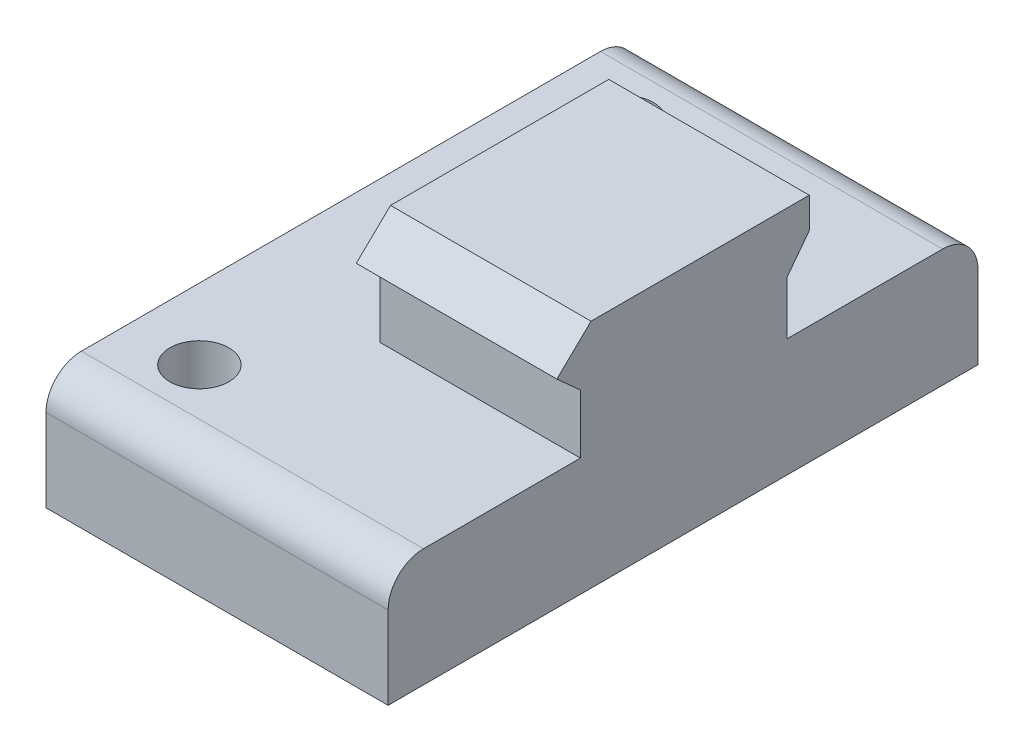
ISO-10303-21;
HEADER;
FILE_DESCRIPTION(('STEP AP214'),'2;1');
FILE_NAME('part.step','',(''),(''),'','','');
FILE_SCHEMA(('AUTOMOTIVE_DESIGN { 1 0 10303 214 1 1 1 1 }'));
ENDSEC;
DATA;
#1=APPLICATION_CONTEXT('core data for automotive mechanical design processes');
#2=APPLICATION_PROTOCOL_DEFINITION('international standard','automotive_design',2000,#1);
#3=PRODUCT_CONTEXT('',#1,'mechanical');
#4=PRODUCT('Part','Part','',(#3));
#5=PRODUCT_RELATED_PRODUCT_CATEGORY('part','',(#4));
#6=PRODUCT_DEFINITION_FORMATION('','',#4);
#7=PRODUCT_DEFINITION_CONTEXT('part definition',#1,'design');
#8=PRODUCT_DEFINITION('design','',#6,#7);
#9=PRODUCT_DEFINITION_SHAPE('','',#8);
#10=(LENGTH_UNIT() NAMED_UNIT(*) SI_UNIT(.MILLI.,.METRE.));
#11=(NAMED_UNIT(*) PLANE_ANGLE_UNIT() SI_UNIT($,.RADIAN.));
#12=(NAMED_UNIT(*) SI_UNIT($,.STERADIAN.) SOLID_ANGLE_UNIT());
#13=UNCERTAINTY_MEASURE_WITH_UNIT(LENGTH_MEASURE(1.E-05),#10,'distance_accuracy_value','');
#14=(GEOMETRIC_REPRESENTATION_CONTEXT(3) GLOBAL_UNCERTAINTY_ASSIGNED_CONTEXT((#13)) GLOBAL_UNIT_ASSIGNED_CONTEXT((#10,
#11,#12)) REPRESENTATION_CONTEXT('',''));
#15=CARTESIAN_POINT('',(0.,0.,0.));
#16=DIRECTION('',(0.,0.,1.));
#17=DIRECTION('',(1.,0.,0.));
#18=AXIS2_PLACEMENT_3D('',#15,#16,#17);
#19=CARTESIAN_POINT('',(-17.,0.,8.7));
#20=DIRECTION('',(0.,0.,1.));
#21=DIRECTION('',(0.,-1.,0.));
#22=AXIS2_PLACEMENT_3D('',#19,#20,#21);
#23=PLANE('',#22);
#24=DIRECTION('',(0.,-1.,0.));
#25=VECTOR('',#24,1.);
#26=CARTESIAN_POINT('',(0.,0.,8.7));
#27=LINE('',#26,#25);
#28=CARTESIAN_POINT('',(0.,-4.6,8.7));
#29=VERTEX_POINT('',#28);
#30=CARTESIAN_POINT('',(0.,-9.6,8.7));
#31=VERTEX_POINT('',#30);
#32=EDGE_CURVE('E169',#29,#31,#27,.T.);
#33=ORIENTED_EDGE('',*,*,#32,.F.);
#34=DIRECTION('',(1.,0.,0.));
#35=VECTOR('',#34,1.);
#36=CARTESIAN_POINT('',(-17.,-4.6,8.7));
#37=LINE('',#36,#35);
#38=CARTESIAN_POINT('',(-17.,-4.6,8.7));
#39=VERTEX_POINT('',#38);
#40=EDGE_CURVE('E215',#39,#29,#37,.T.);
#41=ORIENTED_EDGE('',*,*,#40,.F.);
#42=DIRECTION('',(0.,-1.,0.));
#43=VECTOR('',#42,1.);
#44=CARTESIAN_POINT('',(-17.,0.,8.7));
#45=LINE('',#44,#43);
#46=CARTESIAN_POINT('',(-17.,-9.6,8.7));
#47=VERTEX_POINT('',#46);
#48=EDGE_CURVE('E171',#39,#47,#45,.T.);
#49=ORIENTED_EDGE('',*,*,#48,.T.);
#50=DIRECTION('',(1.,0.,0.));
#51=VECTOR('',#50,1.);
#52=CARTESIAN_POINT('',(-17.,-9.6,8.7));
#53=LINE('',#52,#51);
#54=EDGE_CURVE('E195',#47,#31,#53,.T.);
#55=ORIENTED_EDGE('',*,*,#54,.T.);
#56=EDGE_LOOP('',(#33,#41,#49,#55));
#57=FACE_BOUND('',#56,.T.);
#58=ADVANCED_FACE('F37',(#57),#23,.T.);
#59=CARTESIAN_POINT('',(-17.,-6.86740331491713,6.18066298342541));
#60=DIRECTION('',(0.,-0.743294146247166,0.66896473162245));
#61=DIRECTION('',(0.,-0.66896473162245,-0.743294146247166));
#62=AXIS2_PLACEMENT_3D('',#59,#60,#61);
#63=PLANE('',#62);
#64=DIRECTION('',(0.,-0.66896473162245,-0.743294146247166));
#65=VECTOR('',#64,1.);
#66=CARTESIAN_POINT('',(0.,-6.86740331491713,6.18066298342541));
#67=LINE('',#66,#65);
#68=CARTESIAN_POINT('',(0.,-2.8,10.7));
#69=VERTEX_POINT('',#68);
#70=EDGE_CURVE('E175',#69,#29,#67,.T.);
#71=ORIENTED_EDGE('',*,*,#70,.F.);
#72=DIRECTION('',(1.,0.,0.));
#73=VECTOR('',#72,1.);
#74=CARTESIAN_POINT('',(-17.,-2.8,10.7));
#75=LINE('',#74,#73);
#76=CARTESIAN_POINT('',(-17.,-2.8,10.7));
#77=VERTEX_POINT('',#76);
#78=EDGE_CURVE('E218',#77,#69,#75,.T.);
#79=ORIENTED_EDGE('',*,*,#78,.F.);
#80=DIRECTION('',(0.,-0.66896473162245,-0.743294146247166));
#81=VECTOR('',#80,1.);
#82=CARTESIAN_POINT('',(-17.,-6.86740331491713,6.18066298342541));
#83=LINE('',#82,#81);
#84=EDGE_CURVE('E192',#77,#39,#83,.T.);
#85=ORIENTED_EDGE('',*,*,#84,.T.);
#86=ORIENTED_EDGE('',*,*,#40,.T.);
#87=EDGE_LOOP('',(#71,#79,#85,#86));
#88=FACE_BOUND('',#87,.T.);
#89=ADVANCED_FACE('F265',(#88),#63,.T.);
#90=CARTESIAN_POINT('',(-17.,3.8976,3.7632));
#91=DIRECTION('',(0.,0.719401460617409,0.694594513699567));
#92=DIRECTION('',(0.,-0.694594513699567,0.719401460617409));
#93=AXIS2_PLACEMENT_3D('',#90,#91,#92);
#94=PLANE('',#93);
#95=DIRECTION('',(0.,-0.694594513699567,0.719401460617409));
#96=VECTOR('',#95,1.);
#97=CARTESIAN_POINT('',(0.,3.8976,3.7632));
#98=LINE('',#97,#96);
#99=CARTESIAN_POINT('',(0.,0.,7.8));
#100=VERTEX_POINT('',#99);
#101=EDGE_CURVE('E210',#100,#69,#98,.T.);
#102=ORIENTED_EDGE('',*,*,#101,.F.);
#103=DIRECTION('',(1.,0.,0.));
#104=VECTOR('',#103,1.);
#105=CARTESIAN_POINT('',(-17.,0.,7.8));
#106=LINE('',#105,#104);
#107=CARTESIAN_POINT('',(-17.,0.,7.8));
#108=VERTEX_POINT('',#107);
#109=EDGE_CURVE('E220',#108,#100,#106,.T.);
#110=ORIENTED_EDGE('',*,*,#109,.F.);
#111=DIRECTION('',(0.,-0.694594513699567,0.719401460617409));
#112=VECTOR('',#111,1.);
#113=CARTESIAN_POINT('',(-17.,3.8976,3.7632));
#114=LINE('',#113,#112);
#115=EDGE_CURVE('E189',#108,#77,#114,.T.);
#116=ORIENTED_EDGE('',*,*,#115,.T.);
#117=ORIENTED_EDGE('',*,*,#78,.T.);
#118=EDGE_LOOP('',(#102,#110,#116,#117));
#119=FACE_BOUND('',#118,.T.);
#120=ADVANCED_FACE('F270',(#119),#94,.T.);
#121=CARTESIAN_POINT('',(-17.,0.,0.));
#122=DIRECTION('',(0.,-1.,0.));
#123=DIRECTION('',(0.,0.,-1.));
#124=AXIS2_PLACEMENT_3D('',#121,#122,#123);
#125=PLANE('',#124);
#126=DIRECTION('',(0.,0.,-1.));
#127=VECTOR('',#126,1.);
#128=CARTESIAN_POINT('',(0.,0.,0.));
#129=LINE('',#128,#127);
#130=CARTESIAN_POINT('',(0.,0.,-10.7));
#131=VERTEX_POINT('',#130);
#132=EDGE_CURVE('E207',#100,#131,#129,.T.);
#133=ORIENTED_EDGE('',*,*,#132,.T.);
#134=DIRECTION('',(1.,0.,0.));
#135=VECTOR('',#134,1.);
#136=CARTESIAN_POINT('',(-17.,0.,-10.7));
#137=LINE('',#136,#135);
#138=CARTESIAN_POINT('',(-17.,0.,-10.7));
#139=VERTEX_POINT('',#138);
#140=EDGE_CURVE('E222',#139,#131,#137,.T.);
#141=ORIENTED_EDGE('',*,*,#140,.F.);
#142=DIRECTION('',(0.,0.,-1.));
#143=VECTOR('',#142,1.);
#144=CARTESIAN_POINT('',(-17.,0.,0.));
#145=LINE('',#144,#143);
#146=EDGE_CURVE('E187',#108,#139,#145,.T.);
#147=ORIENTED_EDGE('',*,*,#146,.F.);
#148=ORIENTED_EDGE('',*,*,#109,.T.);
#149=EDGE_LOOP('',(#133,#141,#147,#148));
#150=FACE_BOUND('',#149,.T.);
#151=ADVANCED_FACE('F287',(#150),#125,.F.);
#152=CARTESIAN_POINT('',(-17.,0.,-10.7));
#153=DIRECTION('',(0.,0.,-1.));
#154=DIRECTION('',(-1.,0.,0.));
#155=AXIS2_PLACEMENT_3D('',#152,#153,#154);
#156=PLANE('',#155);
#157=DIRECTION('',(0.,1.,0.));
#158=VECTOR('',#157,1.);
#159=CARTESIAN_POINT('',(0.,0.,-10.7));
#160=LINE('',#159,#158);
#161=CARTESIAN_POINT('',(0.,-2.6,-10.7));
#162=VERTEX_POINT('',#161);
#163=EDGE_CURVE('E204',#162,#131,#160,.T.);
#164=ORIENTED_EDGE('',*,*,#163,.F.);
#165=DIRECTION('',(1.,0.,0.));
#166=VECTOR('',#165,1.);
#167=CARTESIAN_POINT('',(-17.,-2.6,-10.7));
#168=LINE('',#167,#166);
#169=CARTESIAN_POINT('',(-17.,-2.6,-10.7));
#170=VERTEX_POINT('',#169);
#171=EDGE_CURVE('E224',#170,#162,#168,.T.);
#172=ORIENTED_EDGE('',*,*,#171,.F.);
#173=DIRECTION('',(0.,1.,0.));
#174=VECTOR('',#173,1.);
#175=CARTESIAN_POINT('',(-17.,0.,-10.7));
#176=LINE('',#175,#174);
#177=EDGE_CURVE('E184',#170,#139,#176,.T.);
#178=ORIENTED_EDGE('',*,*,#177,.T.);
#179=ORIENTED_EDGE('',*,*,#140,.T.);
#180=EDGE_LOOP('',(#164,#172,#178,#179));
#181=FACE_BOUND('',#180,.T.);
#182=ADVANCED_FACE('F283',(#181),#156,.T.);
#183=CARTESIAN_POINT('',(-17.,-6.10659229208925,-8.03498985801217));
#184=DIRECTION('',(0.,-0.605083267533558,-0.796162194123103));
#185=DIRECTION('',(0.,0.796162194123103,-0.605083267533558));
#186=AXIS2_PLACEMENT_3D('',#183,#184,#185);
#187=PLANE('',#186);
#188=DIRECTION('',(0.,0.796162194123103,-0.605083267533558));
#189=VECTOR('',#188,1.);
#190=CARTESIAN_POINT('',(0.,-6.10659229208925,-8.03498985801217));
#191=LINE('',#190,#189);
#192=CARTESIAN_POINT('',(0.,-5.1,-8.8));
#193=VERTEX_POINT('',#192);
#194=EDGE_CURVE('E201',#193,#162,#191,.T.);
#195=ORIENTED_EDGE('',*,*,#194,.F.);
#196=DIRECTION('',(1.,0.,0.));
#197=VECTOR('',#196,1.);
#198=CARTESIAN_POINT('',(-17.,-5.1,-8.8));
#199=LINE('',#198,#197);
#200=CARTESIAN_POINT('',(-17.,-5.1,-8.8));
#201=VERTEX_POINT('',#200);
#202=EDGE_CURVE('E226',#201,#193,#199,.T.);
#203=ORIENTED_EDGE('',*,*,#202,.F.);
#204=DIRECTION('',(0.,0.796162194123103,-0.605083267533558));
#205=VECTOR('',#204,1.);
#206=CARTESIAN_POINT('',(-17.,-6.10659229208925,-8.03498985801217));
#207=LINE('',#206,#205);
#208=EDGE_CURVE('E181',#201,#170,#207,.T.);
#209=ORIENTED_EDGE('',*,*,#208,.T.);
#210=ORIENTED_EDGE('',*,*,#171,.T.);
#211=EDGE_LOOP('',(#195,#203,#209,#210));
#212=FACE_BOUND('',#211,.T.);
#213=ADVANCED_FACE('F279',(#212),#187,.T.);
#214=CARTESIAN_POINT('',(-17.,0.,-8.8));
#215=DIRECTION('',(0.,0.,-1.));
#216=DIRECTION('',(-1.,0.,0.));
#217=AXIS2_PLACEMENT_3D('',#214,#215,#216);
#218=PLANE('',#217);
#219=DIRECTION('',(0.,1.,0.));
#220=VECTOR('',#219,1.);
#221=CARTESIAN_POINT('',(0.,0.,-8.8));
#222=LINE('',#221,#220);
#223=CARTESIAN_POINT('',(0.,-9.6,-8.8));
#224=VERTEX_POINT('',#223);
#225=EDGE_CURVE('E198',#224,#193,#222,.T.);
#226=ORIENTED_EDGE('',*,*,#225,.F.);
#227=DIRECTION('',(1.,0.,0.));
#228=VECTOR('',#227,1.);
#229=CARTESIAN_POINT('',(-17.,-9.6,-8.8));
#230=LINE('',#229,#228);
#231=CARTESIAN_POINT('',(-17.,-9.6,-8.8));
#232=VERTEX_POINT('',#231);
#233=EDGE_CURVE('E228',#232,#224,#230,.T.);
#234=ORIENTED_EDGE('',*,*,#233,.F.);
#235=DIRECTION('',(0.,1.,0.));
#236=VECTOR('',#235,1.);
#237=CARTESIAN_POINT('',(-17.,0.,-8.8));
#238=LINE('',#237,#236);
#239=EDGE_CURVE('E178',#232,#201,#238,.T.);
#240=ORIENTED_EDGE('',*,*,#239,.T.);
#241=ORIENTED_EDGE('',*,*,#202,.T.);
#242=EDGE_LOOP('',(#226,#234,#240,#241));
#243=FACE_BOUND('',#242,.T.);
#244=ADVANCED_FACE('F275',(#243),#218,.T.);
#245=CARTESIAN_POINT('',(-17.,0.,0.));
#246=DIRECTION('',(1.,0.,0.));
#247=DIRECTION('',(0.,0.,-1.));
#248=AXIS2_PLACEMENT_3D('',#245,#246,#247);
#249=PLANE('',#248);
#250=ORIENTED_EDGE('',*,*,#48,.F.);
#251=ORIENTED_EDGE('',*,*,#84,.F.);
#252=ORIENTED_EDGE('',*,*,#115,.F.);
#253=ORIENTED_EDGE('',*,*,#146,.T.);
#254=ORIENTED_EDGE('',*,*,#177,.F.);
#255=ORIENTED_EDGE('',*,*,#208,.F.);
#256=ORIENTED_EDGE('',*,*,#239,.F.);
#257=DIRECTION('',(0.,0.,-1.));
#258=VECTOR('',#257,1.);
#259=CARTESIAN_POINT('',(-17.,-9.6,0.));
#260=LINE('',#259,#258);
#261=EDGE_CURVE('E174',#47,#232,#260,.T.);
#262=ORIENTED_EDGE('',*,*,#261,.F.);
#263=EDGE_LOOP('',(#250,#251,#252,#253,#254,#255,#256,#262));
#264=FACE_BOUND('',#263,.T.);
#265=ADVANCED_FACE('F278',(#264),#249,.F.);
#266=CARTESIAN_POINT('',(0.,0.,0.));
#267=DIRECTION('',(1.,0.,0.));
#268=DIRECTION('',(0.,0.,-1.));
#269=AXIS2_PLACEMENT_3D('',#266,#267,#268);
#270=PLANE('',#269);
#271=DIRECTION('',(0.,0.,-1.));
#272=VECTOR('',#271,1.);
#273=CARTESIAN_POINT('',(0.,-9.6,0.));
#274=LINE('',#273,#272);
#275=CARTESIAN_POINT('',(0.,-9.6,22.));
#276=VERTEX_POINT('',#275);
#277=EDGE_CURVE('E149',#276,#31,#274,.T.);
#278=ORIENTED_EDGE('',*,*,#277,.F.);
#279=CARTESIAN_POINT('',(0.,-12.6,22.));
#280=DIRECTION('',(1.,0.,0.));
#281=DIRECTION('',(0.,0.,-1.));
#282=AXIS2_PLACEMENT_3D('',#279,#280,#281);
#283=CIRCLE('',#282,3.);
#284=CARTESIAN_POINT('',(0.,-12.6,25.));
#285=VERTEX_POINT('',#284);
#286=EDGE_CURVE('E148',#276,#285,#283,.T.);
#287=ORIENTED_EDGE('',*,*,#286,.T.);
#288=DIRECTION('',(0.,-1.,0.));
#289=VECTOR('',#288,1.);
#290=CARTESIAN_POINT('',(0.,0.,25.));
#291=LINE('',#290,#289);
#292=CARTESIAN_POINT('',(0.,-19.6,25.));
#293=VERTEX_POINT('',#292);
#294=EDGE_CURVE('E140',#285,#293,#291,.T.);
#295=ORIENTED_EDGE('',*,*,#294,.T.);
#296=DIRECTION('',(0.,0.,-1.));
#297=VECTOR('',#296,1.);
#298=CARTESIAN_POINT('',(0.,-19.6,0.));
#299=LINE('',#298,#297);
#300=CARTESIAN_POINT('',(0.,-19.6,-25.));
#301=VERTEX_POINT('',#300);
#302=EDGE_CURVE('E146',#293,#301,#299,.T.);
#303=ORIENTED_EDGE('',*,*,#302,.T.);
#304=DIRECTION('',(0.,1.,0.));
#305=VECTOR('',#304,1.);
#306=CARTESIAN_POINT('',(0.,0.,-25.));
#307=LINE('',#306,#305);
#308=CARTESIAN_POINT('',(0.,-12.6,-25.));
#309=VERTEX_POINT('',#308);
#310=EDGE_CURVE('E158',#301,#309,#307,.T.);
#311=ORIENTED_EDGE('',*,*,#310,.T.);
#312=CARTESIAN_POINT('',(0.,-12.6,-22.));
#313=DIRECTION('',(1.,0.,0.));
#314=DIRECTION('',(0.,0.,-1.));
#315=AXIS2_PLACEMENT_3D('',#312,#313,#314);
#316=CIRCLE('',#315,3.);
#317=CARTESIAN_POINT('',(0.,-9.6,-22.));
#318=VERTEX_POINT('',#317);
#319=EDGE_CURVE('E237',#309,#318,#316,.T.);
#320=ORIENTED_EDGE('',*,*,#319,.T.);
#321=EDGE_CURVE('E332',#224,#318,#274,.T.);
#322=ORIENTED_EDGE('',*,*,#321,.F.);
#323=ORIENTED_EDGE('',*,*,#225,.T.);
#324=ORIENTED_EDGE('',*,*,#194,.T.);
#325=ORIENTED_EDGE('',*,*,#163,.T.);
#326=ORIENTED_EDGE('',*,*,#132,.F.);
#327=ORIENTED_EDGE('',*,*,#101,.T.);
#328=ORIENTED_EDGE('',*,*,#70,.T.);
#329=ORIENTED_EDGE('',*,*,#32,.T.);
#330=EDGE_LOOP('',(#278,#287,#295,#303,#311,#320,#322,#323,#324,#325,#326,#327,#328,#329));
#331=FACE_BOUND('',#330,.T.);
#332=ADVANCED_FACE('F143',(#331),#270,.T.);
#333=CARTESIAN_POINT('',(-91.9901951359279,-9.6,0.));
#334=DIRECTION('',(0.,-1.,0.));
#335=DIRECTION('',(0.,0.,-1.));
#336=AXIS2_PLACEMENT_3D('',#333,#334,#335);
#337=PLANE('',#336);
#338=CARTESIAN_POINT('',(-23.,-9.6,18.));
#339=DIRECTION('',(0.,1.,0.));
#340=DIRECTION('',(0.,0.,1.));
#341=AXIS2_PLACEMENT_3D('',#338,#339,#340);
#342=CIRCLE('',#341,2.5);
#343=CARTESIAN_POINT('',(-23.,-9.6,20.5));
#344=VERTEX_POINT('',#343);
#345=EDGE_CURVE('E327',#344,#344,#342,.T.);
#346=ORIENTED_EDGE('',*,*,#345,.F.);
#347=EDGE_LOOP('',(#346));
#348=FACE_BOUND('',#347,.T.);
#349=CARTESIAN_POINT('',(-23.,-9.6,-18.));
#350=DIRECTION('',(0.,1.,0.));
#351=DIRECTION('',(0.,0.,-1.));
#352=AXIS2_PLACEMENT_3D('',#349,#350,#351);
#353=CIRCLE('',#352,2.5);
#354=CARTESIAN_POINT('',(-23.,-9.6,-20.5));
#355=VERTEX_POINT('',#354);
#356=EDGE_CURVE('E324',#355,#355,#353,.T.);
#357=ORIENTED_EDGE('',*,*,#356,.F.);
#358=EDGE_LOOP('',(#357));
#359=FACE_BOUND('',#358,.T.);
#360=DIRECTION('',(0.,0.,1.));
#361=VECTOR('',#360,1.);
#362=CARTESIAN_POINT('',(-29.,-9.6,0.));
#363=LINE('',#362,#361);
#364=CARTESIAN_POINT('',(-29.,-9.6,-22.));
#365=VERTEX_POINT('',#364);
#366=CARTESIAN_POINT('',(-29.,-9.6,22.));
#367=VERTEX_POINT('',#366);
#368=EDGE_CURVE('E170',#365,#367,#363,.T.);
#369=ORIENTED_EDGE('',*,*,#368,.T.);
#370=DIRECTION('',(1.,0.,0.));
#371=VECTOR('',#370,1.);
#372=CARTESIAN_POINT('',(0.,-9.6,22.));
#373=LINE('',#372,#371);
#374=EDGE_CURVE('E234',#367,#276,#373,.T.);
#375=ORIENTED_EDGE('',*,*,#374,.T.);
#376=ORIENTED_EDGE('',*,*,#277,.T.);
#377=ORIENTED_EDGE('',*,*,#54,.F.);
#378=ORIENTED_EDGE('',*,*,#261,.T.);
#379=ORIENTED_EDGE('',*,*,#233,.T.);
#380=ORIENTED_EDGE('',*,*,#321,.T.);
#381=DIRECTION('',(1.,0.,0.));
#382=VECTOR('',#381,1.);
#383=CARTESIAN_POINT('',(-29.,-9.6,-22.));
#384=LINE('',#383,#382);
#385=EDGE_CURVE('E217',#318,#365,#384,.F.);
#386=ORIENTED_EDGE('',*,*,#385,.T.);
#387=EDGE_LOOP('',(#369,#375,#376,#377,#378,#379,#380,#386));
#388=FACE_BOUND('',#387,.T.);
#389=ADVANCED_FACE('F247',(#348,#359,#388),#337,.F.);
#390=CARTESIAN_POINT('',(-91.9901951359279,0.,-25.));
#391=DIRECTION('',(0.,0.,-1.));
#392=DIRECTION('',(0.,1.,0.));
#393=AXIS2_PLACEMENT_3D('',#390,#391,#392);
#394=PLANE('',#393);
#395=DIRECTION('',(0.,-1.,0.));
#396=VECTOR('',#395,1.);
#397=CARTESIAN_POINT('',(-29.,0.,-25.));
#398=LINE('',#397,#396);
#399=CARTESIAN_POINT('',(-29.,-12.6,-25.));
#400=VERTEX_POINT('',#399);
#401=CARTESIAN_POINT('',(-29.,-19.6,-25.));
#402=VERTEX_POINT('',#401);
#403=EDGE_CURVE('E250',#400,#402,#398,.T.);
#404=ORIENTED_EDGE('',*,*,#403,.F.);
#405=DIRECTION('',(1.,0.,0.));
#406=VECTOR('',#405,1.);
#407=CARTESIAN_POINT('',(0.,-12.6,-25.));
#408=LINE('',#407,#406);
#409=EDGE_CURVE('E12',#400,#309,#408,.T.);
#410=ORIENTED_EDGE('',*,*,#409,.T.);
#411=ORIENTED_EDGE('',*,*,#310,.F.);
#412=DIRECTION('',(1.,0.,0.));
#413=VECTOR('',#412,1.);
#414=CARTESIAN_POINT('',(-91.9901951359279,-19.6,-25.));
#415=LINE('',#414,#413);
#416=EDGE_CURVE('E157',#402,#301,#415,.T.);
#417=ORIENTED_EDGE('',*,*,#416,.F.);
#418=EDGE_LOOP('',(#404,#410,#411,#417));
#419=FACE_BOUND('',#418,.T.);
#420=ADVANCED_FACE('F302',(#419),#394,.T.);
#421=CARTESIAN_POINT('',(-91.9901951359279,-19.6,0.));
#422=DIRECTION('',(0.,-1.,0.));
#423=DIRECTION('',(0.,0.,-1.));
#424=AXIS2_PLACEMENT_3D('',#421,#422,#423);
#425=PLANE('',#424);
#426=CARTESIAN_POINT('',(-23.,-19.6,18.));
#427=DIRECTION('',(0.,1.,0.));
#428=DIRECTION('',(0.,0.,1.));
#429=AXIS2_PLACEMENT_3D('',#426,#427,#428);
#430=CIRCLE('',#429,2.5);
#431=CARTESIAN_POINT('',(-23.,-19.6,20.5));
#432=VERTEX_POINT('',#431);
#433=EDGE_CURVE('E334',#432,#432,#430,.T.);
#434=ORIENTED_EDGE('',*,*,#433,.T.);
#435=EDGE_LOOP('',(#434));
#436=FACE_BOUND('',#435,.T.);
#437=CARTESIAN_POINT('',(-23.,-19.6,-18.));
#438=DIRECTION('',(0.,1.,0.));
#439=DIRECTION('',(0.,0.,-1.));
#440=AXIS2_PLACEMENT_3D('',#437,#438,#439);
#441=CIRCLE('',#440,2.5);
#442=CARTESIAN_POINT('',(-23.,-19.6,-20.5));
#443=VERTEX_POINT('',#442);
#444=EDGE_CURVE('E321',#443,#443,#441,.T.);
#445=ORIENTED_EDGE('',*,*,#444,.T.);
#446=EDGE_LOOP('',(#445));
#447=FACE_BOUND('',#446,.T.);
#448=DIRECTION('',(0.,0.,1.));
#449=VECTOR('',#448,1.);
#450=CARTESIAN_POINT('',(-29.,-19.6,0.));
#451=LINE('',#450,#449);
#452=CARTESIAN_POINT('',(-29.,-19.6,25.));
#453=VERTEX_POINT('',#452);
#454=EDGE_CURVE('E166',#402,#453,#451,.T.);
#455=ORIENTED_EDGE('',*,*,#454,.F.);
#456=ORIENTED_EDGE('',*,*,#416,.T.);
#457=ORIENTED_EDGE('',*,*,#302,.F.);
#458=DIRECTION('',(1.,0.,0.));
#459=VECTOR('',#458,1.);
#460=CARTESIAN_POINT('',(-91.9901951359279,-19.6,25.));
#461=LINE('',#460,#459);
#462=EDGE_CURVE('E152',#453,#293,#461,.T.);
#463=ORIENTED_EDGE('',*,*,#462,.F.);
#464=EDGE_LOOP('',(#455,#456,#457,#463));
#465=FACE_BOUND('',#464,.T.);
#466=ADVANCED_FACE('F160',(#436,#447,#465),#425,.T.);
#467=CARTESIAN_POINT('',(-91.9901951359279,0.,25.));
#468=DIRECTION('',(0.,0.,1.));
#469=DIRECTION('',(0.,-1.,0.));
#470=AXIS2_PLACEMENT_3D('',#467,#468,#469);
#471=PLANE('',#470);
#472=ORIENTED_EDGE('',*,*,#294,.F.);
#473=DIRECTION('',(1.,0.,0.));
#474=VECTOR('',#473,1.);
#475=CARTESIAN_POINT('',(-29.,-12.6,25.));
#476=LINE('',#475,#474);
#477=CARTESIAN_POINT('',(-29.,-12.6,25.));
#478=VERTEX_POINT('',#477);
#479=EDGE_CURVE('E60',#285,#478,#476,.F.);
#480=ORIENTED_EDGE('',*,*,#479,.T.);
#481=DIRECTION('',(0.,1.,0.));
#482=VECTOR('',#481,1.);
#483=CARTESIAN_POINT('',(-29.,0.,25.));
#484=LINE('',#483,#482);
#485=EDGE_CURVE('E154',#453,#478,#484,.T.);
#486=ORIENTED_EDGE('',*,*,#485,.F.);
#487=ORIENTED_EDGE('',*,*,#462,.T.);
#488=EDGE_LOOP('',(#472,#480,#486,#487));
#489=FACE_BOUND('',#488,.T.);
#490=ADVANCED_FACE('F153',(#489),#471,.T.);
#491=CARTESIAN_POINT('',(-29.,0.,0.));
#492=DIRECTION('',(1.,0.,0.));
#493=DIRECTION('',(0.,0.,-1.));
#494=AXIS2_PLACEMENT_3D('',#491,#492,#493);
#495=PLANE('',#494);
#496=ORIENTED_EDGE('',*,*,#485,.T.);
#497=CARTESIAN_POINT('',(-29.,-12.6,22.));
#498=DIRECTION('',(1.,0.,0.));
#499=DIRECTION('',(0.,0.,-1.));
#500=AXIS2_PLACEMENT_3D('',#497,#498,#499);
#501=CIRCLE('',#500,3.);
#502=EDGE_CURVE('E45',#478,#367,#501,.F.);
#503=ORIENTED_EDGE('',*,*,#502,.T.);
#504=ORIENTED_EDGE('',*,*,#368,.F.);
#505=CARTESIAN_POINT('',(-29.,-12.6,-22.));
#506=DIRECTION('',(1.,0.,0.));
#507=DIRECTION('',(0.,0.,-1.));
#508=AXIS2_PLACEMENT_3D('',#505,#506,#507);
#509=CIRCLE('',#508,3.);
#510=EDGE_CURVE('E52',#365,#400,#509,.F.);
#511=ORIENTED_EDGE('',*,*,#510,.T.);
#512=ORIENTED_EDGE('',*,*,#403,.T.);
#513=ORIENTED_EDGE('',*,*,#454,.T.);
#514=EDGE_LOOP('',(#496,#503,#504,#511,#512,#513));
#515=FACE_BOUND('',#514,.T.);
#516=ADVANCED_FACE('F243',(#515),#495,.F.);
#517=CARTESIAN_POINT('',(-23.,-19.6,-18.));
#518=DIRECTION('',(0.,1.,0.));
#519=DIRECTION('',(0.,0.,1.));
#520=AXIS2_PLACEMENT_3D('',#517,#518,#519);
#521=CYLINDRICAL_SURFACE('',#520,2.5);
#522=ORIENTED_EDGE('',*,*,#444,.F.);
#523=EDGE_LOOP('',(#522));
#524=FACE_BOUND('',#523,.T.);
#525=ORIENTED_EDGE('',*,*,#356,.T.);
#526=EDGE_LOOP('',(#525));
#527=FACE_BOUND('',#526,.T.);
#528=ADVANCED_FACE('F260',(#524,#527),#521,.F.);
#529=CARTESIAN_POINT('',(-23.,-19.6,18.));
#530=DIRECTION('',(0.,1.,0.));
#531=DIRECTION('',(0.,0.,1.));
#532=AXIS2_PLACEMENT_3D('',#529,#530,#531);
#533=CYLINDRICAL_SURFACE('',#532,2.5);
#534=ORIENTED_EDGE('',*,*,#433,.F.);
#535=EDGE_LOOP('',(#534));
#536=FACE_BOUND('',#535,.T.);
#537=ORIENTED_EDGE('',*,*,#345,.T.);
#538=EDGE_LOOP('',(#537));
#539=FACE_BOUND('',#538,.T.);
#540=ADVANCED_FACE('F254',(#536,#539),#533,.F.);
#541=CARTESIAN_POINT('',(-91.9901951359279,-12.6,22.));
#542=DIRECTION('',(-1.,0.,0.));
#543=DIRECTION('',(0.,0.,1.));
#544=AXIS2_PLACEMENT_3D('',#541,#542,#543);
#545=CYLINDRICAL_SURFACE('',#544,3.);
#546=ORIENTED_EDGE('',*,*,#502,.F.);
#547=ORIENTED_EDGE('',*,*,#479,.F.);
#548=ORIENTED_EDGE('',*,*,#286,.F.);
#549=ORIENTED_EDGE('',*,*,#374,.F.);
#550=EDGE_LOOP('',(#546,#547,#548,#549));
#551=FACE_BOUND('',#550,.T.);
#552=ADVANCED_FACE('F252',(#551),#545,.T.);
#553=CARTESIAN_POINT('',(-91.9901951359279,-12.6,-22.));
#554=DIRECTION('',(-1.,0.,0.));
#555=DIRECTION('',(0.,0.,1.));
#556=AXIS2_PLACEMENT_3D('',#553,#554,#555);
#557=CYLINDRICAL_SURFACE('',#556,3.);
#558=ORIENTED_EDGE('',*,*,#510,.F.);
#559=ORIENTED_EDGE('',*,*,#385,.F.);
#560=ORIENTED_EDGE('',*,*,#319,.F.);
#561=ORIENTED_EDGE('',*,*,#409,.F.);
#562=EDGE_LOOP('',(#558,#559,#560,#561));
#563=FACE_BOUND('',#562,.T.);
#564=ADVANCED_FACE('F39',(#563),#557,.T.);
#565=CLOSED_SHELL('',(#58,#89,#120,#151,#182,#213,#244,#265,#332,#389,#420,#466,#490,#516,#528,
#540,#552,#564));
#566=MANIFOLD_SOLID_BREP('B2',#565);
#567=ADVANCED_BREP_SHAPE_REPRESENTATION('',(#18,#566),#14);
#568=SHAPE_DEFINITION_REPRESENTATION(#9,#567);
ENDSEC;
END-ISO-10303-21;
